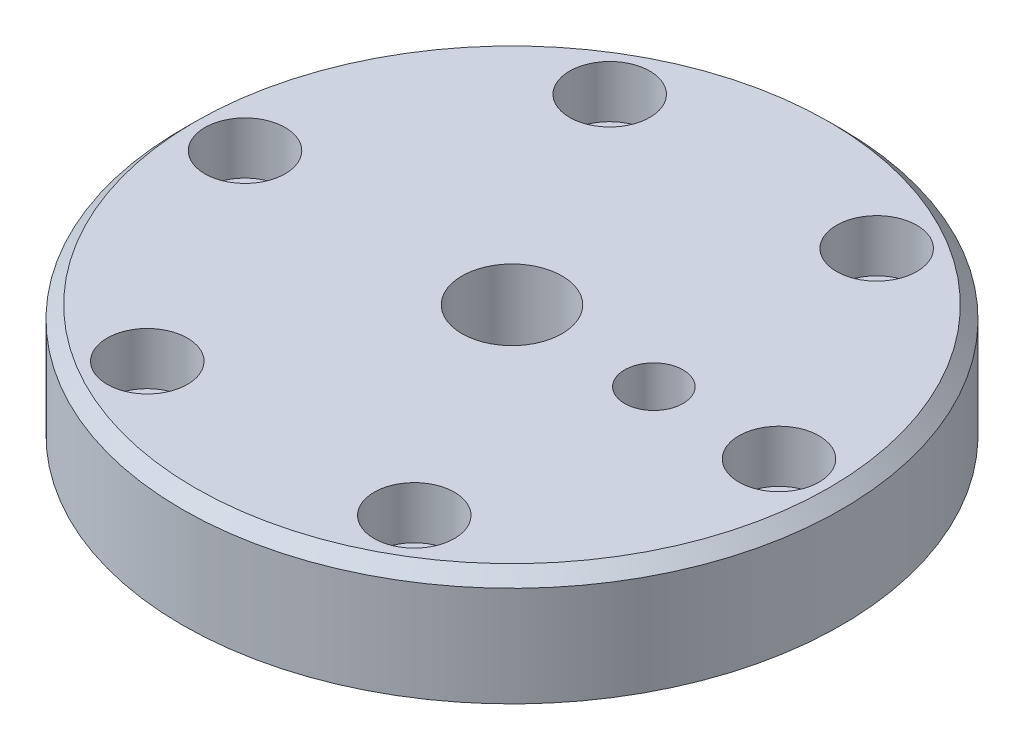
ISO-10303-21;
HEADER;
FILE_DESCRIPTION(('STEP AP214'),'2;1');
FILE_NAME('part.step','',(''),(''),'','','');
FILE_SCHEMA(('AUTOMOTIVE_DESIGN { 1 0 10303 214 1 1 1 1 }'));
ENDSEC;
DATA;
#1=APPLICATION_CONTEXT('core data for automotive mechanical design processes');
#2=APPLICATION_PROTOCOL_DEFINITION('international standard','automotive_design',2000,#1);
#3=PRODUCT_CONTEXT('',#1,'mechanical');
#4=PRODUCT('Part','Part','',(#3));
#5=PRODUCT_RELATED_PRODUCT_CATEGORY('part','',(#4));
#6=PRODUCT_DEFINITION_FORMATION('','',#4);
#7=PRODUCT_DEFINITION_CONTEXT('part definition',#1,'design');
#8=PRODUCT_DEFINITION('design','',#6,#7);
#9=PRODUCT_DEFINITION_SHAPE('','',#8);
#10=(LENGTH_UNIT() NAMED_UNIT(*) SI_UNIT(.MILLI.,.METRE.));
#11=(NAMED_UNIT(*) PLANE_ANGLE_UNIT() SI_UNIT($,.RADIAN.));
#12=(NAMED_UNIT(*) SI_UNIT($,.STERADIAN.) SOLID_ANGLE_UNIT());
#13=UNCERTAINTY_MEASURE_WITH_UNIT(LENGTH_MEASURE(1.E-05),#10,'distance_accuracy_value','');
#14=(GEOMETRIC_REPRESENTATION_CONTEXT(3) GLOBAL_UNCERTAINTY_ASSIGNED_CONTEXT((#13)) GLOBAL_UNIT_ASSIGNED_CONTEXT((#10,
#11,#12)) REPRESENTATION_CONTEXT('',''));
#15=CARTESIAN_POINT('',(0.,0.,0.));
#16=DIRECTION('',(0.,0.,1.));
#17=DIRECTION('',(1.,0.,0.));
#18=AXIS2_PLACEMENT_3D('',#15,#16,#17);
#19=CARTESIAN_POINT('',(0.,0.,0.));
#20=DIRECTION('',(0.,1.,0.));
#21=DIRECTION('',(0.,0.,1.));
#22=AXIS2_PLACEMENT_3D('',#19,#20,#21);
#23=PLANE('',#22);
#24=CARTESIAN_POINT('',(0.,0.,0.));
#25=DIRECTION('',(0.,1.,0.));
#26=DIRECTION('',(0.,0.,1.));
#27=AXIS2_PLACEMENT_3D('',#24,#25,#26);
#28=CIRCLE('',#27,12.);
#29=CARTESIAN_POINT('',(0.,0.,12.));
#30=VERTEX_POINT('',#29);
#31=EDGE_CURVE('E165',#30,#30,#28,.T.);
#32=ORIENTED_EDGE('',*,*,#31,.T.);
#33=EDGE_LOOP('',(#32));
#34=FACE_BOUND('',#33,.T.);
#35=CARTESIAN_POINT('',(0.,0.,0.));
#36=DIRECTION('',(0.,1.,0.));
#37=DIRECTION('',(0.,0.,1.));
#38=AXIS2_PLACEMENT_3D('',#35,#36,#37);
#39=CIRCLE('',#38,22.);
#40=CARTESIAN_POINT('',(0.,0.,22.));
#41=VERTEX_POINT('',#40);
#42=EDGE_CURVE('E333',#41,#41,#39,.T.);
#43=ORIENTED_EDGE('',*,*,#42,.F.);
#44=EDGE_LOOP('',(#43));
#45=FACE_BOUND('',#44,.T.);
#46=ADVANCED_FACE('F39',(#34,#45),#23,.F.);
#47=CARTESIAN_POINT('',(0.,27.,0.));
#48=DIRECTION('',(0.,1.,0.));
#49=DIRECTION('',(0.,0.,1.));
#50=AXIS2_PLACEMENT_3D('',#47,#48,#49);
#51=PLANE('',#50);
#52=CARTESIAN_POINT('',(0.,27.,0.));
#53=DIRECTION('',(0.,1.,0.));
#54=DIRECTION('',(0.,0.,1.));
#55=AXIS2_PLACEMENT_3D('',#52,#53,#54);
#56=CIRCLE('',#55,76.);
#57=CARTESIAN_POINT('',(0.,27.,76.));
#58=VERTEX_POINT('',#57);
#59=EDGE_CURVE('E47',#58,#58,#56,.T.);
#60=ORIENTED_EDGE('',*,*,#59,.T.);
#61=EDGE_LOOP('',(#60));
#62=FACE_BOUND('',#61,.T.);
#63=CARTESIAN_POINT('',(34.,27.,0.));
#64=DIRECTION('',(0.,1.,0.));
#65=DIRECTION('',(0.,0.,1.));
#66=AXIS2_PLACEMENT_3D('',#63,#64,#65);
#67=CIRCLE('',#66,6.99999999999999);
#68=CARTESIAN_POINT('',(34.,27.,6.99999999999999));
#69=VERTEX_POINT('',#68);
#70=EDGE_CURVE('E62',#69,#69,#67,.T.);
#71=ORIENTED_EDGE('',*,*,#70,.F.);
#72=EDGE_LOOP('',(#71));
#73=FACE_BOUND('',#72,.T.);
#74=CARTESIAN_POINT('',(64.,27.,-1.51302581574697E-11));
#75=DIRECTION('',(0.,1.,0.));
#76=DIRECTION('',(0.,0.,1.));
#77=AXIS2_PLACEMENT_3D('',#74,#75,#76);
#78=CIRCLE('',#77,9.62499999999999);
#79=CARTESIAN_POINT('',(64.,27.,9.62499999998486));
#80=VERTEX_POINT('',#79);
#81=EDGE_CURVE('E61',#80,#80,#78,.T.);
#82=ORIENTED_EDGE('',*,*,#81,.F.);
#83=EDGE_LOOP('',(#82));
#84=FACE_BOUND('',#83,.T.);
#85=CARTESIAN_POINT('',(32.000000000013,27.,55.4256258421966));
#86=DIRECTION('',(0.,1.,0.));
#87=DIRECTION('',(0.,0.,1.));
#88=AXIS2_PLACEMENT_3D('',#85,#86,#87);
#89=CIRCLE('',#88,9.62499999999999);
#90=CARTESIAN_POINT('',(32.000000000013,27.,65.0506258421966));
#91=VERTEX_POINT('',#90);
#92=EDGE_CURVE('E85',#91,#91,#89,.T.);
#93=ORIENTED_EDGE('',*,*,#92,.F.);
#94=EDGE_LOOP('',(#93));
#95=FACE_BOUND('',#94,.T.);
#96=CARTESIAN_POINT('',(-31.9999999999875,27.,55.4256258422113));
#97=DIRECTION('',(0.,1.,0.));
#98=DIRECTION('',(0.,0.,1.));
#99=AXIS2_PLACEMENT_3D('',#96,#97,#98);
#100=CIRCLE('',#99,9.62499999999999);
#101=CARTESIAN_POINT('',(-31.9999999999875,27.,65.0506258422113));
#102=VERTEX_POINT('',#101);
#103=EDGE_CURVE('E101',#102,#102,#100,.T.);
#104=ORIENTED_EDGE('',*,*,#103,.F.);
#105=EDGE_LOOP('',(#104));
#106=FACE_BOUND('',#105,.T.);
#107=CARTESIAN_POINT('',(-64.,27.,1.46826995006677E-11));
#108=DIRECTION('',(0.,1.,0.));
#109=DIRECTION('',(0.,0.,1.));
#110=AXIS2_PLACEMENT_3D('',#107,#108,#109);
#111=CIRCLE('',#110,9.62499999999999);
#112=CARTESIAN_POINT('',(-64.,27.,9.62500000001468));
#113=VERTEX_POINT('',#112);
#114=EDGE_CURVE('E117',#113,#113,#111,.T.);
#115=ORIENTED_EDGE('',*,*,#114,.F.);
#116=EDGE_LOOP('',(#115));
#117=FACE_BOUND('',#116,.T.);
#118=CARTESIAN_POINT('',(-32.0000000000126,27.,-55.4256258421968));
#119=DIRECTION('',(0.,1.,0.));
#120=DIRECTION('',(0.,0.,1.));
#121=AXIS2_PLACEMENT_3D('',#118,#119,#120);
#122=CIRCLE('',#121,9.62499999999999);
#123=CARTESIAN_POINT('',(-32.0000000000126,27.,-45.8006258421968));
#124=VERTEX_POINT('',#123);
#125=EDGE_CURVE('E133',#124,#124,#122,.T.);
#126=ORIENTED_EDGE('',*,*,#125,.F.);
#127=EDGE_LOOP('',(#126));
#128=FACE_BOUND('',#127,.T.);
#129=CARTESIAN_POINT('',(31.9999999999875,27.,-55.4256258422113));
#130=DIRECTION('',(0.,1.,0.));
#131=DIRECTION('',(0.,0.,1.));
#132=AXIS2_PLACEMENT_3D('',#129,#130,#131);
#133=CIRCLE('',#132,9.62499999999999);
#134=CARTESIAN_POINT('',(31.9999999999875,27.,-45.8006258422113));
#135=VERTEX_POINT('',#134);
#136=EDGE_CURVE('E149',#135,#135,#133,.T.);
#137=ORIENTED_EDGE('',*,*,#136,.F.);
#138=EDGE_LOOP('',(#137));
#139=FACE_BOUND('',#138,.T.);
#140=CARTESIAN_POINT('',(0.,27.,0.));
#141=DIRECTION('',(0.,1.,0.));
#142=DIRECTION('',(0.,0.,1.));
#143=AXIS2_PLACEMENT_3D('',#140,#141,#142);
#144=CIRCLE('',#143,12.);
#145=CARTESIAN_POINT('',(0.,27.,12.));
#146=VERTEX_POINT('',#145);
#147=EDGE_CURVE('E166',#146,#146,#144,.T.);
#148=ORIENTED_EDGE('',*,*,#147,.F.);
#149=EDGE_LOOP('',(#148));
#150=FACE_BOUND('',#149,.T.);
#151=ADVANCED_FACE('F180',(#62,#73,#84,#95,#106,#117,#128,#139,#150),#51,.T.);
#152=CARTESIAN_POINT('',(0.,0.,0.));
#153=DIRECTION('',(0.,1.,0.));
#154=DIRECTION('',(0.,0.,1.));
#155=AXIS2_PLACEMENT_3D('',#152,#153,#154);
#156=CIRCLE('',#155,33.);
#157=CARTESIAN_POINT('',(0.,0.,33.));
#158=VERTEX_POINT('',#157);
#159=EDGE_CURVE('E213',#158,#158,#156,.T.);
#160=ORIENTED_EDGE('',*,*,#159,.T.);
#161=EDGE_LOOP('',(#160));
#162=FACE_BOUND('',#161,.T.);
#163=CARTESIAN_POINT('',(64.,0.,-1.51302581574697E-11));
#164=DIRECTION('',(0.,1.,0.));
#165=DIRECTION('',(0.,0.,1.));
#166=AXIS2_PLACEMENT_3D('',#163,#164,#165);
#167=CIRCLE('',#166,6.24999999999999);
#168=CARTESIAN_POINT('',(64.,0.,6.24999999998486));
#169=VERTEX_POINT('',#168);
#170=EDGE_CURVE('E81',#169,#169,#167,.T.);
#171=ORIENTED_EDGE('',*,*,#170,.T.);
#172=EDGE_LOOP('',(#171));
#173=FACE_BOUND('',#172,.T.);
#174=CARTESIAN_POINT('',(32.000000000013,0.,55.4256258421966));
#175=DIRECTION('',(0.,1.,0.));
#176=DIRECTION('',(0.,0.,1.));
#177=AXIS2_PLACEMENT_3D('',#174,#175,#176);
#178=CIRCLE('',#177,6.24999999999999);
#179=CARTESIAN_POINT('',(32.000000000013,0.,61.6756258421966));
#180=VERTEX_POINT('',#179);
#181=EDGE_CURVE('E97',#180,#180,#178,.T.);
#182=ORIENTED_EDGE('',*,*,#181,.T.);
#183=EDGE_LOOP('',(#182));
#184=FACE_BOUND('',#183,.T.);
#185=CARTESIAN_POINT('',(-31.9999999999875,0.,55.4256258422113));
#186=DIRECTION('',(0.,1.,0.));
#187=DIRECTION('',(0.,0.,1.));
#188=AXIS2_PLACEMENT_3D('',#185,#186,#187);
#189=CIRCLE('',#188,6.24999999999999);
#190=CARTESIAN_POINT('',(-31.9999999999875,0.,61.6756258422113));
#191=VERTEX_POINT('',#190);
#192=EDGE_CURVE('E113',#191,#191,#189,.T.);
#193=ORIENTED_EDGE('',*,*,#192,.T.);
#194=EDGE_LOOP('',(#193));
#195=FACE_BOUND('',#194,.T.);
#196=CARTESIAN_POINT('',(-64.,0.,1.46826995006677E-11));
#197=DIRECTION('',(0.,1.,0.));
#198=DIRECTION('',(0.,0.,1.));
#199=AXIS2_PLACEMENT_3D('',#196,#197,#198);
#200=CIRCLE('',#199,6.24999999999999);
#201=CARTESIAN_POINT('',(-64.,0.,6.25000000001467));
#202=VERTEX_POINT('',#201);
#203=EDGE_CURVE('E129',#202,#202,#200,.T.);
#204=ORIENTED_EDGE('',*,*,#203,.T.);
#205=EDGE_LOOP('',(#204));
#206=FACE_BOUND('',#205,.T.);
#207=CARTESIAN_POINT('',(-32.0000000000126,0.,-55.4256258421968));
#208=DIRECTION('',(0.,1.,0.));
#209=DIRECTION('',(0.,0.,1.));
#210=AXIS2_PLACEMENT_3D('',#207,#208,#209);
#211=CIRCLE('',#210,6.24999999999999);
#212=CARTESIAN_POINT('',(-32.0000000000126,0.,-49.1756258421968));
#213=VERTEX_POINT('',#212);
#214=EDGE_CURVE('E145',#213,#213,#211,.T.);
#215=ORIENTED_EDGE('',*,*,#214,.T.);
#216=EDGE_LOOP('',(#215));
#217=FACE_BOUND('',#216,.T.);
#218=CARTESIAN_POINT('',(31.9999999999875,0.,-55.4256258422113));
#219=DIRECTION('',(0.,1.,0.));
#220=DIRECTION('',(0.,0.,1.));
#221=AXIS2_PLACEMENT_3D('',#218,#219,#220);
#222=CIRCLE('',#221,6.24999999999999);
#223=CARTESIAN_POINT('',(31.9999999999875,0.,-49.1756258422113));
#224=VERTEX_POINT('',#223);
#225=EDGE_CURVE('E161',#224,#224,#222,.T.);
#226=ORIENTED_EDGE('',*,*,#225,.T.);
#227=EDGE_LOOP('',(#226));
#228=FACE_BOUND('',#227,.T.);
#229=CARTESIAN_POINT('',(0.,0.,0.));
#230=DIRECTION('',(0.,1.,0.));
#231=DIRECTION('',(0.,0.,1.));
#232=AXIS2_PLACEMENT_3D('',#229,#230,#231);
#233=CIRCLE('',#232,79.);
#234=CARTESIAN_POINT('',(0.,0.,79.));
#235=VERTEX_POINT('',#234);
#236=EDGE_CURVE('E170',#235,#235,#233,.T.);
#237=ORIENTED_EDGE('',*,*,#236,.F.);
#238=EDGE_LOOP('',(#237));
#239=FACE_BOUND('',#238,.T.);
#240=ADVANCED_FACE('F196',(#162,#173,#184,#195,#206,#217,#228,#239),#23,.F.);
#241=CARTESIAN_POINT('',(0.,27.,0.));
#242=DIRECTION('',(0.,-1.,0.));
#243=DIRECTION('',(0.,0.,-1.));
#244=AXIS2_PLACEMENT_3D('',#241,#242,#243);
#245=CYLINDRICAL_SURFACE('',#244,79.);
#246=CARTESIAN_POINT('',(0.,24.,0.));
#247=DIRECTION('',(0.,1.,0.));
#248=DIRECTION('',(0.,0.,1.));
#249=AXIS2_PLACEMENT_3D('',#246,#247,#248);
#250=CIRCLE('',#249,79.);
#251=CARTESIAN_POINT('',(0.,24.,79.));
#252=VERTEX_POINT('',#251);
#253=EDGE_CURVE('E11',#252,#252,#250,.F.);
#254=ORIENTED_EDGE('',*,*,#253,.T.);
#255=EDGE_LOOP('',(#254));
#256=FACE_BOUND('',#255,.T.);
#257=ORIENTED_EDGE('',*,*,#236,.T.);
#258=EDGE_LOOP('',(#257));
#259=FACE_BOUND('',#258,.T.);
#260=ADVANCED_FACE('F203',(#256,#259),#245,.T.);
#261=CARTESIAN_POINT('',(0.,27.,0.));
#262=DIRECTION('',(0.,-1.,0.));
#263=DIRECTION('',(0.,0.,-1.));
#264=AXIS2_PLACEMENT_3D('',#261,#262,#263);
#265=CYLINDRICAL_SURFACE('',#264,12.);
#266=ORIENTED_EDGE('',*,*,#147,.T.);
#267=EDGE_LOOP('',(#266));
#268=FACE_BOUND('',#267,.T.);
#269=ORIENTED_EDGE('',*,*,#31,.F.);
#270=EDGE_LOOP('',(#269));
#271=FACE_BOUND('',#270,.T.);
#272=ADVANCED_FACE('F208',(#268,#271),#265,.F.);
#273=CARTESIAN_POINT('',(31.9999999999875,27.,-55.4256258422113));
#274=DIRECTION('',(0.,1.,0.));
#275=DIRECTION('',(0.,0.,1.));
#276=AXIS2_PLACEMENT_3D('',#273,#274,#275);
#277=CYLINDRICAL_SURFACE('',#276,6.25);
#278=ORIENTED_EDGE('',*,*,#225,.F.);
#279=EDGE_LOOP('',(#278));
#280=FACE_BOUND('',#279,.T.);
#281=CARTESIAN_POINT('',(31.9999999999875,14.5,-55.4256258422113));
#282=DIRECTION('',(0.,1.,0.));
#283=DIRECTION('',(0.,0.,1.));
#284=AXIS2_PLACEMENT_3D('',#281,#282,#283);
#285=CIRCLE('',#284,6.25000000000001);
#286=CARTESIAN_POINT('',(31.9999999999875,14.5,-49.1756258422113));
#287=VERTEX_POINT('',#286);
#288=EDGE_CURVE('E157',#287,#287,#285,.T.);
#289=ORIENTED_EDGE('',*,*,#288,.T.);
#290=EDGE_LOOP('',(#289));
#291=FACE_BOUND('',#290,.T.);
#292=ADVANCED_FACE('F229',(#280,#291),#277,.F.);
#293=CARTESIAN_POINT('',(38.2499999999876,14.5,-55.4256258422113));
#294=DIRECTION('',(0.,-1.,0.));
#295=DIRECTION('',(0.,0.,-1.));
#296=AXIS2_PLACEMENT_3D('',#293,#294,#295);
#297=PLANE('',#296);
#298=ORIENTED_EDGE('',*,*,#288,.F.);
#299=EDGE_LOOP('',(#298));
#300=FACE_BOUND('',#299,.T.);
#301=CARTESIAN_POINT('',(31.9999999999875,14.5,-55.4256258422113));
#302=DIRECTION('',(0.,1.,0.));
#303=DIRECTION('',(0.,0.,1.));
#304=AXIS2_PLACEMENT_3D('',#301,#302,#303);
#305=CIRCLE('',#304,9.62499999999999);
#306=CARTESIAN_POINT('',(31.9999999999875,14.5,-45.8006258422113));
#307=VERTEX_POINT('',#306);
#308=EDGE_CURVE('E153',#307,#307,#305,.T.);
#309=ORIENTED_EDGE('',*,*,#308,.T.);
#310=EDGE_LOOP('',(#309));
#311=FACE_BOUND('',#310,.T.);
#312=ADVANCED_FACE('F232',(#300,#311),#297,.F.);
#313=CARTESIAN_POINT('',(31.9999999999875,27.,-55.4256258422113));
#314=DIRECTION('',(0.,1.,0.));
#315=DIRECTION('',(0.,0.,1.));
#316=AXIS2_PLACEMENT_3D('',#313,#314,#315);
#317=CYLINDRICAL_SURFACE('',#316,9.62499999999999);
#318=ORIENTED_EDGE('',*,*,#308,.F.);
#319=EDGE_LOOP('',(#318));
#320=FACE_BOUND('',#319,.T.);
#321=ORIENTED_EDGE('',*,*,#136,.T.);
#322=EDGE_LOOP('',(#321));
#323=FACE_BOUND('',#322,.T.);
#324=ADVANCED_FACE('F238',(#320,#323),#317,.F.);
#325=CARTESIAN_POINT('',(-32.0000000000126,27.,-55.4256258421968));
#326=DIRECTION('',(0.,1.,0.));
#327=DIRECTION('',(0.,0.,1.));
#328=AXIS2_PLACEMENT_3D('',#325,#326,#327);
#329=CYLINDRICAL_SURFACE('',#328,6.25);
#330=ORIENTED_EDGE('',*,*,#214,.F.);
#331=EDGE_LOOP('',(#330));
#332=FACE_BOUND('',#331,.T.);
#333=CARTESIAN_POINT('',(-32.0000000000126,14.5,-55.4256258421968));
#334=DIRECTION('',(0.,1.,0.));
#335=DIRECTION('',(0.,0.,1.));
#336=AXIS2_PLACEMENT_3D('',#333,#334,#335);
#337=CIRCLE('',#336,6.25000000000001);
#338=CARTESIAN_POINT('',(-32.0000000000126,14.5,-49.1756258421968));
#339=VERTEX_POINT('',#338);
#340=EDGE_CURVE('E141',#339,#339,#337,.T.);
#341=ORIENTED_EDGE('',*,*,#340,.T.);
#342=EDGE_LOOP('',(#341));
#343=FACE_BOUND('',#342,.T.);
#344=ADVANCED_FACE('F244',(#332,#343),#329,.F.);
#345=CARTESIAN_POINT('',(-25.7500000000126,14.5,-55.4256258421968));
#346=DIRECTION('',(0.,-1.,0.));
#347=DIRECTION('',(0.,0.,-1.));
#348=AXIS2_PLACEMENT_3D('',#345,#346,#347);
#349=PLANE('',#348);
#350=ORIENTED_EDGE('',*,*,#340,.F.);
#351=EDGE_LOOP('',(#350));
#352=FACE_BOUND('',#351,.T.);
#353=CARTESIAN_POINT('',(-32.0000000000126,14.5,-55.4256258421968));
#354=DIRECTION('',(0.,1.,0.));
#355=DIRECTION('',(0.,0.,1.));
#356=AXIS2_PLACEMENT_3D('',#353,#354,#355);
#357=CIRCLE('',#356,9.62499999999999);
#358=CARTESIAN_POINT('',(-32.0000000000126,14.5,-45.8006258421968));
#359=VERTEX_POINT('',#358);
#360=EDGE_CURVE('E137',#359,#359,#357,.T.);
#361=ORIENTED_EDGE('',*,*,#360,.T.);
#362=EDGE_LOOP('',(#361));
#363=FACE_BOUND('',#362,.T.);
#364=ADVANCED_FACE('F260',(#352,#363),#349,.F.);
#365=CARTESIAN_POINT('',(-32.0000000000126,27.,-55.4256258421968));
#366=DIRECTION('',(0.,1.,0.));
#367=DIRECTION('',(0.,0.,1.));
#368=AXIS2_PLACEMENT_3D('',#365,#366,#367);
#369=CYLINDRICAL_SURFACE('',#368,9.62499999999999);
#370=ORIENTED_EDGE('',*,*,#360,.F.);
#371=EDGE_LOOP('',(#370));
#372=FACE_BOUND('',#371,.T.);
#373=ORIENTED_EDGE('',*,*,#125,.T.);
#374=EDGE_LOOP('',(#373));
#375=FACE_BOUND('',#374,.T.);
#376=ADVANCED_FACE('F264',(#372,#375),#369,.F.);
#377=CARTESIAN_POINT('',(-64.,27.,1.46826995006677E-11));
#378=DIRECTION('',(0.,1.,0.));
#379=DIRECTION('',(0.,0.,1.));
#380=AXIS2_PLACEMENT_3D('',#377,#378,#379);
#381=CYLINDRICAL_SURFACE('',#380,6.25);
#382=ORIENTED_EDGE('',*,*,#203,.F.);
#383=EDGE_LOOP('',(#382));
#384=FACE_BOUND('',#383,.T.);
#385=CARTESIAN_POINT('',(-64.,14.5,1.46826995006677E-11));
#386=DIRECTION('',(0.,1.,0.));
#387=DIRECTION('',(0.,0.,1.));
#388=AXIS2_PLACEMENT_3D('',#385,#386,#387);
#389=CIRCLE('',#388,6.25000000000001);
#390=CARTESIAN_POINT('',(-64.,14.5,6.25000000001469));
#391=VERTEX_POINT('',#390);
#392=EDGE_CURVE('E125',#391,#391,#389,.T.);
#393=ORIENTED_EDGE('',*,*,#392,.T.);
#394=EDGE_LOOP('',(#393));
#395=FACE_BOUND('',#394,.T.);
#396=ADVANCED_FACE('F268',(#384,#395),#381,.F.);
#397=CARTESIAN_POINT('',(-57.75,14.5,1.46826995006677E-11));
#398=DIRECTION('',(0.,-1.,0.));
#399=DIRECTION('',(0.,0.,-1.));
#400=AXIS2_PLACEMENT_3D('',#397,#398,#399);
#401=PLANE('',#400);
#402=ORIENTED_EDGE('',*,*,#392,.F.);
#403=EDGE_LOOP('',(#402));
#404=FACE_BOUND('',#403,.T.);
#405=CARTESIAN_POINT('',(-64.,14.5,1.46826995006677E-11));
#406=DIRECTION('',(0.,1.,0.));
#407=DIRECTION('',(0.,0.,1.));
#408=AXIS2_PLACEMENT_3D('',#405,#406,#407);
#409=CIRCLE('',#408,9.62499999999999);
#410=CARTESIAN_POINT('',(-64.,14.5,9.62500000001468));
#411=VERTEX_POINT('',#410);
#412=EDGE_CURVE('E121',#411,#411,#409,.T.);
#413=ORIENTED_EDGE('',*,*,#412,.T.);
#414=EDGE_LOOP('',(#413));
#415=FACE_BOUND('',#414,.T.);
#416=ADVANCED_FACE('F272',(#404,#415),#401,.F.);
#417=CARTESIAN_POINT('',(-64.,27.,1.46826995006677E-11));
#418=DIRECTION('',(0.,1.,0.));
#419=DIRECTION('',(0.,0.,1.));
#420=AXIS2_PLACEMENT_3D('',#417,#418,#419);
#421=CYLINDRICAL_SURFACE('',#420,9.62499999999999);
#422=ORIENTED_EDGE('',*,*,#412,.F.);
#423=EDGE_LOOP('',(#422));
#424=FACE_BOUND('',#423,.T.);
#425=ORIENTED_EDGE('',*,*,#114,.T.);
#426=EDGE_LOOP('',(#425));
#427=FACE_BOUND('',#426,.T.);
#428=ADVANCED_FACE('F276',(#424,#427),#421,.F.);
#429=CARTESIAN_POINT('',(-31.9999999999875,27.,55.4256258422113));
#430=DIRECTION('',(0.,1.,0.));
#431=DIRECTION('',(0.,0.,1.));
#432=AXIS2_PLACEMENT_3D('',#429,#430,#431);
#433=CYLINDRICAL_SURFACE('',#432,6.25);
#434=ORIENTED_EDGE('',*,*,#192,.F.);
#435=EDGE_LOOP('',(#434));
#436=FACE_BOUND('',#435,.T.);
#437=CARTESIAN_POINT('',(-31.9999999999875,14.5,55.4256258422113));
#438=DIRECTION('',(0.,1.,0.));
#439=DIRECTION('',(0.,0.,1.));
#440=AXIS2_PLACEMENT_3D('',#437,#438,#439);
#441=CIRCLE('',#440,6.25000000000001);
#442=CARTESIAN_POINT('',(-31.9999999999875,14.5,61.6756258422113));
#443=VERTEX_POINT('',#442);
#444=EDGE_CURVE('E109',#443,#443,#441,.T.);
#445=ORIENTED_EDGE('',*,*,#444,.T.);
#446=EDGE_LOOP('',(#445));
#447=FACE_BOUND('',#446,.T.);
#448=ADVANCED_FACE('F280',(#436,#447),#433,.F.);
#449=CARTESIAN_POINT('',(-25.7499999999875,14.5,55.4256258422113));
#450=DIRECTION('',(0.,-1.,0.));
#451=DIRECTION('',(0.,0.,-1.));
#452=AXIS2_PLACEMENT_3D('',#449,#450,#451);
#453=PLANE('',#452);
#454=ORIENTED_EDGE('',*,*,#444,.F.);
#455=EDGE_LOOP('',(#454));
#456=FACE_BOUND('',#455,.T.);
#457=CARTESIAN_POINT('',(-31.9999999999875,14.5,55.4256258422113));
#458=DIRECTION('',(0.,1.,0.));
#459=DIRECTION('',(0.,0.,1.));
#460=AXIS2_PLACEMENT_3D('',#457,#458,#459);
#461=CIRCLE('',#460,9.62499999999999);
#462=CARTESIAN_POINT('',(-31.9999999999875,14.5,65.0506258422113));
#463=VERTEX_POINT('',#462);
#464=EDGE_CURVE('E105',#463,#463,#461,.T.);
#465=ORIENTED_EDGE('',*,*,#464,.T.);
#466=EDGE_LOOP('',(#465));
#467=FACE_BOUND('',#466,.T.);
#468=ADVANCED_FACE('F284',(#456,#467),#453,.F.);
#469=CARTESIAN_POINT('',(-31.9999999999875,27.,55.4256258422113));
#470=DIRECTION('',(0.,1.,0.));
#471=DIRECTION('',(0.,0.,1.));
#472=AXIS2_PLACEMENT_3D('',#469,#470,#471);
#473=CYLINDRICAL_SURFACE('',#472,9.62499999999999);
#474=ORIENTED_EDGE('',*,*,#464,.F.);
#475=EDGE_LOOP('',(#474));
#476=FACE_BOUND('',#475,.T.);
#477=ORIENTED_EDGE('',*,*,#103,.T.);
#478=EDGE_LOOP('',(#477));
#479=FACE_BOUND('',#478,.T.);
#480=ADVANCED_FACE('F288',(#476,#479),#473,.F.);
#481=CARTESIAN_POINT('',(32.000000000013,27.,55.4256258421966));
#482=DIRECTION('',(0.,1.,0.));
#483=DIRECTION('',(0.,0.,1.));
#484=AXIS2_PLACEMENT_3D('',#481,#482,#483);
#485=CYLINDRICAL_SURFACE('',#484,6.25);
#486=ORIENTED_EDGE('',*,*,#181,.F.);
#487=EDGE_LOOP('',(#486));
#488=FACE_BOUND('',#487,.T.);
#489=CARTESIAN_POINT('',(32.000000000013,14.5,55.4256258421966));
#490=DIRECTION('',(0.,1.,0.));
#491=DIRECTION('',(0.,0.,1.));
#492=AXIS2_PLACEMENT_3D('',#489,#490,#491);
#493=CIRCLE('',#492,6.25000000000001);
#494=CARTESIAN_POINT('',(32.000000000013,14.5,61.6756258421966));
#495=VERTEX_POINT('',#494);
#496=EDGE_CURVE('E93',#495,#495,#493,.T.);
#497=ORIENTED_EDGE('',*,*,#496,.T.);
#498=EDGE_LOOP('',(#497));
#499=FACE_BOUND('',#498,.T.);
#500=ADVANCED_FACE('F292',(#488,#499),#485,.F.);
#501=CARTESIAN_POINT('',(38.250000000013,14.5,55.4256258421966));
#502=DIRECTION('',(0.,-1.,0.));
#503=DIRECTION('',(0.,0.,-1.));
#504=AXIS2_PLACEMENT_3D('',#501,#502,#503);
#505=PLANE('',#504);
#506=ORIENTED_EDGE('',*,*,#496,.F.);
#507=EDGE_LOOP('',(#506));
#508=FACE_BOUND('',#507,.T.);
#509=CARTESIAN_POINT('',(32.000000000013,14.5,55.4256258421966));
#510=DIRECTION('',(0.,1.,0.));
#511=DIRECTION('',(0.,0.,1.));
#512=AXIS2_PLACEMENT_3D('',#509,#510,#511);
#513=CIRCLE('',#512,9.62499999999999);
#514=CARTESIAN_POINT('',(32.000000000013,14.5,65.0506258421966));
#515=VERTEX_POINT('',#514);
#516=EDGE_CURVE('E89',#515,#515,#513,.T.);
#517=ORIENTED_EDGE('',*,*,#516,.T.);
#518=EDGE_LOOP('',(#517));
#519=FACE_BOUND('',#518,.T.);
#520=ADVANCED_FACE('F296',(#508,#519),#505,.F.);
#521=CARTESIAN_POINT('',(32.000000000013,27.,55.4256258421966));
#522=DIRECTION('',(0.,1.,0.));
#523=DIRECTION('',(0.,0.,1.));
#524=AXIS2_PLACEMENT_3D('',#521,#522,#523);
#525=CYLINDRICAL_SURFACE('',#524,9.62499999999999);
#526=ORIENTED_EDGE('',*,*,#516,.F.);
#527=EDGE_LOOP('',(#526));
#528=FACE_BOUND('',#527,.T.);
#529=ORIENTED_EDGE('',*,*,#92,.T.);
#530=EDGE_LOOP('',(#529));
#531=FACE_BOUND('',#530,.T.);
#532=ADVANCED_FACE('F300',(#528,#531),#525,.F.);
#533=CARTESIAN_POINT('',(64.,27.,-1.51302581574697E-11));
#534=DIRECTION('',(0.,1.,0.));
#535=DIRECTION('',(0.,0.,1.));
#536=AXIS2_PLACEMENT_3D('',#533,#534,#535);
#537=CYLINDRICAL_SURFACE('',#536,6.25);
#538=ORIENTED_EDGE('',*,*,#170,.F.);
#539=EDGE_LOOP('',(#538));
#540=FACE_BOUND('',#539,.T.);
#541=CARTESIAN_POINT('',(64.,14.5,-1.51302581574697E-11));
#542=DIRECTION('',(0.,1.,0.));
#543=DIRECTION('',(0.,0.,1.));
#544=AXIS2_PLACEMENT_3D('',#541,#542,#543);
#545=CIRCLE('',#544,6.25000000000001);
#546=CARTESIAN_POINT('',(64.,14.5,6.24999999998488));
#547=VERTEX_POINT('',#546);
#548=EDGE_CURVE('E77',#547,#547,#545,.T.);
#549=ORIENTED_EDGE('',*,*,#548,.T.);
#550=EDGE_LOOP('',(#549));
#551=FACE_BOUND('',#550,.T.);
#552=ADVANCED_FACE('F304',(#540,#551),#537,.F.);
#553=CARTESIAN_POINT('',(70.25,14.5,-1.51302581574697E-11));
#554=DIRECTION('',(0.,-1.,0.));
#555=DIRECTION('',(0.,0.,-1.));
#556=AXIS2_PLACEMENT_3D('',#553,#554,#555);
#557=PLANE('',#556);
#558=ORIENTED_EDGE('',*,*,#548,.F.);
#559=EDGE_LOOP('',(#558));
#560=FACE_BOUND('',#559,.T.);
#561=CARTESIAN_POINT('',(64.,14.5,-1.51302581574697E-11));
#562=DIRECTION('',(0.,1.,0.));
#563=DIRECTION('',(0.,0.,1.));
#564=AXIS2_PLACEMENT_3D('',#561,#562,#563);
#565=CIRCLE('',#564,9.62499999999999);
#566=CARTESIAN_POINT('',(64.,14.5,9.62499999998486));
#567=VERTEX_POINT('',#566);
#568=EDGE_CURVE('E67',#567,#567,#565,.T.);
#569=ORIENTED_EDGE('',*,*,#568,.T.);
#570=EDGE_LOOP('',(#569));
#571=FACE_BOUND('',#570,.T.);
#572=ADVANCED_FACE('F308',(#560,#571),#557,.F.);
#573=CARTESIAN_POINT('',(64.,27.,-1.51302581574697E-11));
#574=DIRECTION('',(0.,1.,0.));
#575=DIRECTION('',(0.,0.,1.));
#576=AXIS2_PLACEMENT_3D('',#573,#574,#575);
#577=CYLINDRICAL_SURFACE('',#576,9.62499999999999);
#578=ORIENTED_EDGE('',*,*,#568,.F.);
#579=EDGE_LOOP('',(#578));
#580=FACE_BOUND('',#579,.T.);
#581=ORIENTED_EDGE('',*,*,#81,.T.);
#582=EDGE_LOOP('',(#581));
#583=FACE_BOUND('',#582,.T.);
#584=ADVANCED_FACE('F54',(#580,#583),#577,.F.);
#585=CARTESIAN_POINT('',(34.,10.,0.));
#586=DIRECTION('',(0.,1.,0.));
#587=DIRECTION('',(0.,0.,1.));
#588=AXIS2_PLACEMENT_3D('',#585,#586,#587);
#589=CONICAL_SURFACE('',#588,7.,1.02974425867665);
#590=CARTESIAN_POINT('',(34.,5.79397566680707,0.));
#591=VERTEX_POINT('',#590);
#592=VERTEX_LOOP('',#591);
#593=FACE_BOUND('',#592,.T.);
#594=CARTESIAN_POINT('',(34.,10.,0.));
#595=DIRECTION('',(0.,1.,0.));
#596=DIRECTION('',(0.,0.,1.));
#597=AXIS2_PLACEMENT_3D('',#594,#595,#596);
#598=CIRCLE('',#597,7.);
#599=CARTESIAN_POINT('',(34.,10.,7.));
#600=VERTEX_POINT('',#599);
#601=EDGE_CURVE('E58',#600,#600,#598,.T.);
#602=ORIENTED_EDGE('',*,*,#601,.T.);
#603=EDGE_LOOP('',(#602));
#604=FACE_BOUND('',#603,.T.);
#605=ADVANCED_FACE('F50',(#593,#604),#589,.F.);
#606=CARTESIAN_POINT('',(34.,27.,0.));
#607=DIRECTION('',(0.,1.,0.));
#608=DIRECTION('',(0.,0.,1.));
#609=AXIS2_PLACEMENT_3D('',#606,#607,#608);
#610=CYLINDRICAL_SURFACE('',#609,6.99999999999999);
#611=ORIENTED_EDGE('',*,*,#601,.F.);
#612=EDGE_LOOP('',(#611));
#613=FACE_BOUND('',#612,.T.);
#614=ORIENTED_EDGE('',*,*,#70,.T.);
#615=EDGE_LOOP('',(#614));
#616=FACE_BOUND('',#615,.T.);
#617=ADVANCED_FACE('F53',(#613,#616),#610,.F.);
#618=CARTESIAN_POINT('',(0.,6.,0.));
#619=DIRECTION('',(0.,1.,0.));
#620=DIRECTION('',(0.,0.,1.));
#621=AXIS2_PLACEMENT_3D('',#618,#619,#620);
#622=PLANE('',#621);
#623=CARTESIAN_POINT('',(0.,6.,0.));
#624=DIRECTION('',(0.,1.,0.));
#625=DIRECTION('',(0.,0.,1.));
#626=AXIS2_PLACEMENT_3D('',#623,#624,#625);
#627=CIRCLE('',#626,33.);
#628=CARTESIAN_POINT('',(0.,6.,33.));
#629=VERTEX_POINT('',#628);
#630=EDGE_CURVE('E70',#629,#629,#627,.T.);
#631=ORIENTED_EDGE('',*,*,#630,.F.);
#632=EDGE_LOOP('',(#631));
#633=FACE_BOUND('',#632,.T.);
#634=CARTESIAN_POINT('',(0.,6.,0.));
#635=DIRECTION('',(0.,1.,0.));
#636=DIRECTION('',(0.,0.,1.));
#637=AXIS2_PLACEMENT_3D('',#634,#635,#636);
#638=CIRCLE('',#637,22.);
#639=CARTESIAN_POINT('',(0.,6.,22.));
#640=VERTEX_POINT('',#639);
#641=EDGE_CURVE('E331',#640,#640,#638,.T.);
#642=ORIENTED_EDGE('',*,*,#641,.T.);
#643=EDGE_LOOP('',(#642));
#644=FACE_BOUND('',#643,.T.);
#645=ADVANCED_FACE('F318',(#633,#644),#622,.F.);
#646=CARTESIAN_POINT('',(0.,6.,0.));
#647=DIRECTION('',(0.,-1.,0.));
#648=DIRECTION('',(0.,0.,-1.));
#649=AXIS2_PLACEMENT_3D('',#646,#647,#648);
#650=CYLINDRICAL_SURFACE('',#649,33.);
#651=ORIENTED_EDGE('',*,*,#630,.T.);
#652=EDGE_LOOP('',(#651));
#653=FACE_BOUND('',#652,.T.);
#654=ORIENTED_EDGE('',*,*,#159,.F.);
#655=EDGE_LOOP('',(#654));
#656=FACE_BOUND('',#655,.T.);
#657=ADVANCED_FACE('F189',(#653,#656),#650,.F.);
#658=CARTESIAN_POINT('',(0.,6.,0.));
#659=DIRECTION('',(0.,-1.,0.));
#660=DIRECTION('',(0.,0.,-1.));
#661=AXIS2_PLACEMENT_3D('',#658,#659,#660);
#662=CYLINDRICAL_SURFACE('',#661,22.);
#663=ORIENTED_EDGE('',*,*,#641,.F.);
#664=EDGE_LOOP('',(#663));
#665=FACE_BOUND('',#664,.T.);
#666=ORIENTED_EDGE('',*,*,#42,.T.);
#667=EDGE_LOOP('',(#666));
#668=FACE_BOUND('',#667,.T.);
#669=ADVANCED_FACE('F184',(#665,#668),#662,.T.);
#670=CARTESIAN_POINT('',(0.,27.,0.));
#671=DIRECTION('',(0.,-1.,0.));
#672=DIRECTION('',(0.,0.,-1.));
#673=AXIS2_PLACEMENT_3D('',#670,#671,#672);
#674=CONICAL_SURFACE('',#673,76.,0.785398163397444);
#675=ORIENTED_EDGE('',*,*,#253,.F.);
#676=EDGE_LOOP('',(#675));
#677=FACE_BOUND('',#676,.T.);
#678=ORIENTED_EDGE('',*,*,#59,.F.);
#679=EDGE_LOOP('',(#678));
#680=FACE_BOUND('',#679,.T.);
#681=ADVANCED_FACE('F41',(#677,#680),#674,.T.);
#682=CLOSED_SHELL('',(#46,#151,#240,#260,#272,#292,#312,#324,#344,#364,#376,#396,#416,#428,#448,
#468,#480,#500,#520,#532,#552,#572,#584,#605,#617,#645,#657,#669,#681));
#683=MANIFOLD_SOLID_BREP('B2',#682);
#684=ADVANCED_BREP_SHAPE_REPRESENTATION('',(#18,#683),#14);
#685=SHAPE_DEFINITION_REPRESENTATION(#9,#684);
ENDSEC;
END-ISO-10303-21;
